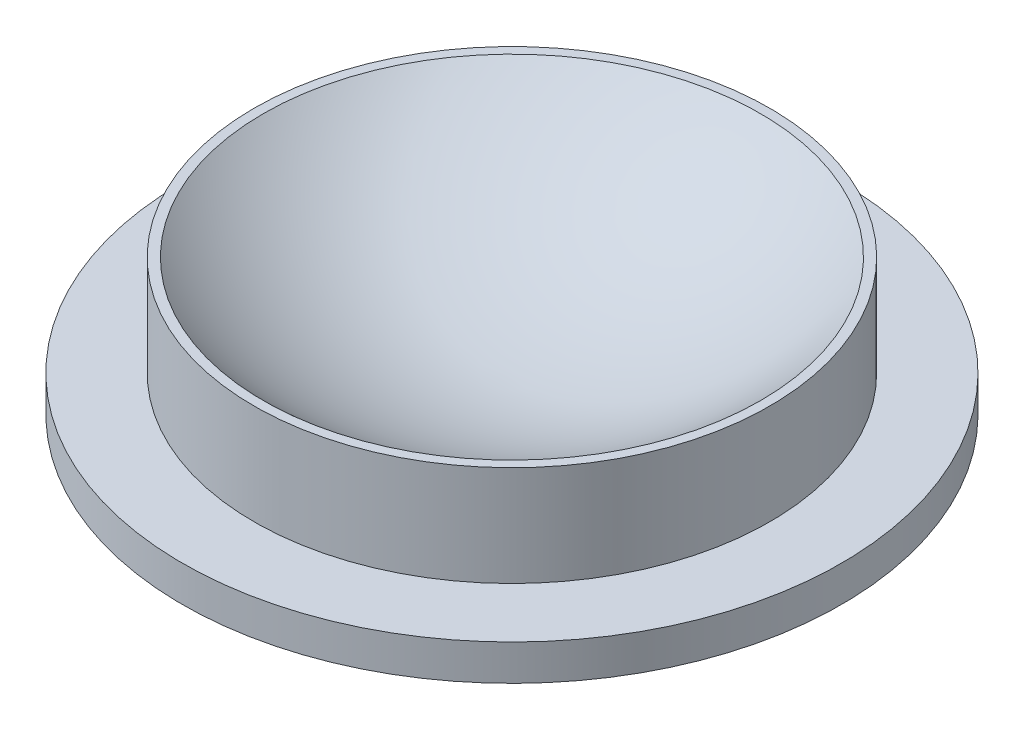
ISO-10303-21;
HEADER;
FILE_DESCRIPTION(('STEP AP214'),'2;1');
FILE_NAME('part.step','',(''),(''),'','','');
FILE_SCHEMA(('AUTOMOTIVE_DESIGN { 1 0 10303 214 1 1 1 1 }'));
ENDSEC;
DATA;
#1=APPLICATION_CONTEXT('core data for automotive mechanical design processes');
#2=APPLICATION_PROTOCOL_DEFINITION('international standard','automotive_design',2000,#1);
#3=PRODUCT_CONTEXT('',#1,'mechanical');
#4=PRODUCT('Part','Part','',(#3));
#5=PRODUCT_RELATED_PRODUCT_CATEGORY('part','',(#4));
#6=PRODUCT_DEFINITION_FORMATION('','',#4);
#7=PRODUCT_DEFINITION_CONTEXT('part definition',#1,'design');
#8=PRODUCT_DEFINITION('design','',#6,#7);
#9=PRODUCT_DEFINITION_SHAPE('','',#8);
#10=(LENGTH_UNIT() NAMED_UNIT(*) SI_UNIT(.MILLI.,.METRE.));
#11=(NAMED_UNIT(*) PLANE_ANGLE_UNIT() SI_UNIT($,.RADIAN.));
#12=(NAMED_UNIT(*) SI_UNIT($,.STERADIAN.) SOLID_ANGLE_UNIT());
#13=UNCERTAINTY_MEASURE_WITH_UNIT(LENGTH_MEASURE(1.E-05),#10,'distance_accuracy_value','');
#14=(GEOMETRIC_REPRESENTATION_CONTEXT(3) GLOBAL_UNCERTAINTY_ASSIGNED_CONTEXT((#13)) GLOBAL_UNIT_ASSIGNED_CONTEXT((#10,
#11,#12)) REPRESENTATION_CONTEXT('',''));
#15=CARTESIAN_POINT('',(0.,0.,0.));
#16=DIRECTION('',(0.,0.,1.));
#17=DIRECTION('',(1.,0.,0.));
#18=AXIS2_PLACEMENT_3D('',#15,#16,#17);
#19=CARTESIAN_POINT('',(0.,-55.,0.));
#20=DIRECTION('',(0.,1.,0.));
#21=DIRECTION('',(-1.,0.,0.));
#22=AXIS2_PLACEMENT_3D('',#19,#20,#21);
#23=PLANE('',#22);
#24=CARTESIAN_POINT('',(0.,-55.,0.));
#25=DIRECTION('',(0.,1.,0.));
#26=DIRECTION('',(-1.,0.,0.));
#27=AXIS2_PLACEMENT_3D('',#24,#25,#26);
#28=CIRCLE('',#27,45.9999999999998);
#29=CARTESIAN_POINT('',(-45.9999999999998,-55.,0.));
#30=VERTEX_POINT('',#29);
#31=EDGE_CURVE('E10',#30,#30,#28,.T.);
#32=ORIENTED_EDGE('',*,*,#31,.F.);
#33=EDGE_LOOP('',(#32));
#34=FACE_BOUND('',#33,.T.);
#35=ADVANCED_FACE('F29',(#34),#23,.F.);
#36=CARTESIAN_POINT('',(0.,-50.,0.));
#37=DIRECTION('',(0.,1.,0.));
#38=DIRECTION('',(-1.,0.,0.));
#39=AXIS2_PLACEMENT_3D('',#36,#37,#38);
#40=CYLINDRICAL_SURFACE('',#39,45.9999999999998);
#41=CARTESIAN_POINT('',(0.,-50.,0.));
#42=DIRECTION('',(0.,1.,0.));
#43=DIRECTION('',(-1.,0.,0.));
#44=AXIS2_PLACEMENT_3D('',#41,#42,#43);
#45=CIRCLE('',#44,45.9999999999998);
#46=CARTESIAN_POINT('',(-45.9999999999998,-50.,0.));
#47=VERTEX_POINT('',#46);
#48=EDGE_CURVE('E35',#47,#47,#45,.T.);
#49=ORIENTED_EDGE('',*,*,#48,.F.);
#50=EDGE_LOOP('',(#49));
#51=FACE_BOUND('',#50,.T.);
#52=ORIENTED_EDGE('',*,*,#31,.T.);
#53=EDGE_LOOP('',(#52));
#54=FACE_BOUND('',#53,.T.);
#55=ADVANCED_FACE('F68',(#51,#54),#40,.T.);
#56=CARTESIAN_POINT('',(35.9999999999998,-50.,0.));
#57=DIRECTION('',(0.,-1.,0.));
#58=DIRECTION('',(1.,0.,0.));
#59=AXIS2_PLACEMENT_3D('',#56,#57,#58);
#60=PLANE('',#59);
#61=CARTESIAN_POINT('',(0.,-50.,0.));
#62=DIRECTION('',(0.,1.,0.));
#63=DIRECTION('',(-1.,0.,0.));
#64=AXIS2_PLACEMENT_3D('',#61,#62,#63);
#65=CIRCLE('',#64,35.9999999999998);
#66=CARTESIAN_POINT('',(-35.9999999999998,-50.,0.));
#67=VERTEX_POINT('',#66);
#68=EDGE_CURVE('E39',#67,#67,#65,.T.);
#69=ORIENTED_EDGE('',*,*,#68,.F.);
#70=EDGE_LOOP('',(#69));
#71=FACE_BOUND('',#70,.T.);
#72=ORIENTED_EDGE('',*,*,#48,.T.);
#73=EDGE_LOOP('',(#72));
#74=FACE_BOUND('',#73,.T.);
#75=ADVANCED_FACE('F63',(#71,#74),#60,.F.);
#76=CARTESIAN_POINT('',(0.,-50.,0.));
#77=DIRECTION('',(0.,1.,0.));
#78=DIRECTION('',(-1.,0.,0.));
#79=AXIS2_PLACEMENT_3D('',#76,#77,#78);
#80=CYLINDRICAL_SURFACE('',#79,35.9999999999999);
#81=CARTESIAN_POINT('',(0.,-36.,0.));
#82=DIRECTION('',(0.,1.,0.));
#83=DIRECTION('',(-1.,0.,0.));
#84=AXIS2_PLACEMENT_3D('',#81,#82,#83);
#85=CIRCLE('',#84,35.9999999999999);
#86=CARTESIAN_POINT('',(-35.9999999999999,-36.,0.));
#87=VERTEX_POINT('',#86);
#88=EDGE_CURVE('E43',#87,#87,#85,.T.);
#89=ORIENTED_EDGE('',*,*,#88,.F.);
#90=EDGE_LOOP('',(#89));
#91=FACE_BOUND('',#90,.T.);
#92=ORIENTED_EDGE('',*,*,#68,.T.);
#93=EDGE_LOOP('',(#92));
#94=FACE_BOUND('',#93,.T.);
#95=ADVANCED_FACE('F57',(#91,#94),#80,.T.);
#96=CARTESIAN_POINT('',(35.9999999999999,-36.,0.));
#97=DIRECTION('',(0.,-1.,0.));
#98=DIRECTION('',(1.,0.,0.));
#99=AXIS2_PLACEMENT_3D('',#96,#97,#98);
#100=PLANE('',#99);
#101=CARTESIAN_POINT('',(0.,-36.,0.));
#102=DIRECTION('',(0.,1.,0.));
#103=DIRECTION('',(-1.,0.,0.));
#104=AXIS2_PLACEMENT_3D('',#101,#102,#103);
#105=CIRCLE('',#104,34.6987031457949);
#106=CARTESIAN_POINT('',(-34.6987031457949,-36.,0.));
#107=VERTEX_POINT('',#106);
#108=EDGE_CURVE('E48',#107,#107,#105,.T.);
#109=ORIENTED_EDGE('',*,*,#108,.F.);
#110=EDGE_LOOP('',(#109));
#111=FACE_BOUND('',#110,.T.);
#112=ORIENTED_EDGE('',*,*,#88,.T.);
#113=EDGE_LOOP('',(#112));
#114=FACE_BOUND('',#113,.T.);
#115=ADVANCED_FACE('F54',(#111,#114),#100,.F.);
#116=CARTESIAN_POINT('',(0.,0.,0.));
#117=DIRECTION('',(0.,1.,0.));
#118=DIRECTION('',(1.,0.,0.));
#119=AXIS2_PLACEMENT_3D('',#116,#117,#118);
#120=SPHERICAL_SURFACE('',#119,50.);
#121=ORIENTED_EDGE('',*,*,#108,.T.);
#122=EDGE_LOOP('',(#121));
#123=FACE_BOUND('',#122,.T.);
#124=ADVANCED_FACE('F52',(#123),#120,.F.);
#125=CLOSED_SHELL('',(#35,#55,#75,#95,#115,#124));
#126=MANIFOLD_SOLID_BREP('B2',#125);
#127=ADVANCED_BREP_SHAPE_REPRESENTATION('',(#18,#126),#14);
#128=SHAPE_DEFINITION_REPRESENTATION(#9,#127);
ENDSEC;
END-ISO-10303-21;
